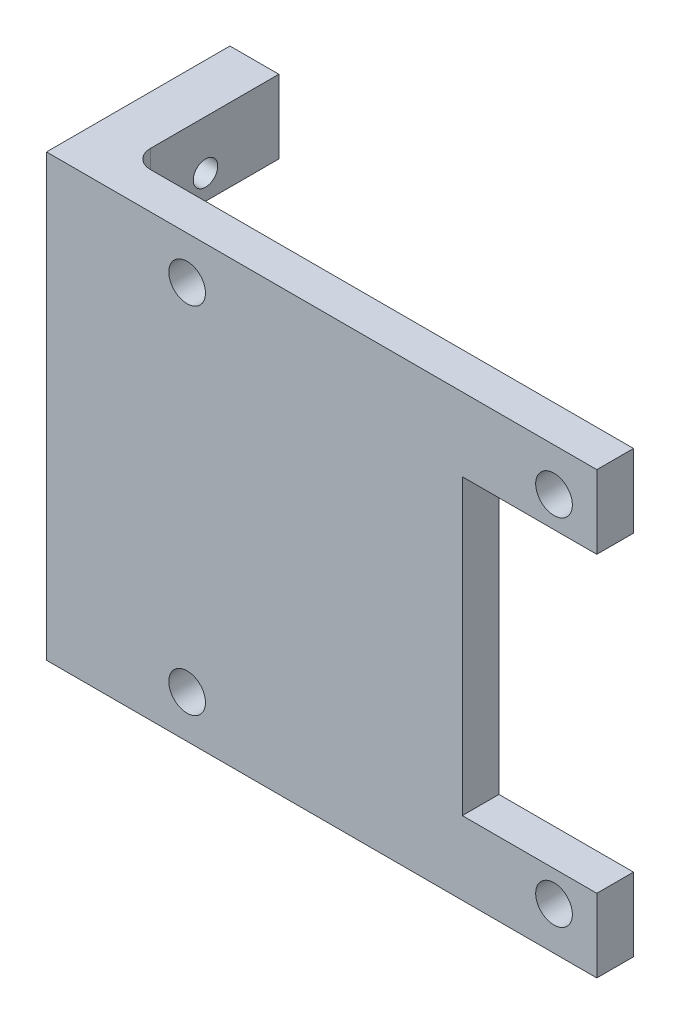
ISO-10303-21;
HEADER;
FILE_DESCRIPTION(('STEP AP214'),'2;1');
FILE_NAME('part.step','',(''),(''),'','','');
FILE_SCHEMA(('AUTOMOTIVE_DESIGN { 1 0 10303 214 1 1 1 1 }'));
ENDSEC;
DATA;
#1=APPLICATION_CONTEXT('core data for automotive mechanical design processes');
#2=APPLICATION_PROTOCOL_DEFINITION('international standard','automotive_design',2000,#1);
#3=PRODUCT_CONTEXT('',#1,'mechanical');
#4=PRODUCT('Part','Part','',(#3));
#5=PRODUCT_RELATED_PRODUCT_CATEGORY('part','',(#4));
#6=PRODUCT_DEFINITION_FORMATION('','',#4);
#7=PRODUCT_DEFINITION_CONTEXT('part definition',#1,'design');
#8=PRODUCT_DEFINITION('design','',#6,#7);
#9=PRODUCT_DEFINITION_SHAPE('','',#8);
#10=(LENGTH_UNIT() NAMED_UNIT(*) SI_UNIT(.MILLI.,.METRE.));
#11=(NAMED_UNIT(*) PLANE_ANGLE_UNIT() SI_UNIT($,.RADIAN.));
#12=(NAMED_UNIT(*) SI_UNIT($,.STERADIAN.) SOLID_ANGLE_UNIT());
#13=UNCERTAINTY_MEASURE_WITH_UNIT(LENGTH_MEASURE(1.E-05),#10,'distance_accuracy_value','');
#14=(GEOMETRIC_REPRESENTATION_CONTEXT(3) GLOBAL_UNCERTAINTY_ASSIGNED_CONTEXT((#13)) GLOBAL_UNIT_ASSIGNED_CONTEXT((#10,
#11,#12)) REPRESENTATION_CONTEXT('',''));
#15=CARTESIAN_POINT('',(0.,0.,0.));
#16=DIRECTION('',(0.,0.,1.));
#17=DIRECTION('',(1.,0.,0.));
#18=AXIS2_PLACEMENT_3D('',#15,#16,#17);
#19=CARTESIAN_POINT('',(18.5,-12.,3.));
#20=DIRECTION('',(-1.,0.,0.));
#21=DIRECTION('',(0.,-1.,0.));
#22=AXIS2_PLACEMENT_3D('',#19,#20,#21);
#23=PLANE('',#22);
#24=DIRECTION('',(0.,1.,0.));
#25=VECTOR('',#24,1.);
#26=CARTESIAN_POINT('',(18.5,-12.,0.));
#27=LINE('',#26,#25);
#28=CARTESIAN_POINT('',(18.5,-18.,0.));
#29=VERTEX_POINT('',#28);
#30=CARTESIAN_POINT('',(18.5,-12.,0.));
#31=VERTEX_POINT('',#30);
#32=EDGE_CURVE('E241',#29,#31,#27,.T.);
#33=ORIENTED_EDGE('',*,*,#32,.T.);
#34=DIRECTION('',(0.,0.,-1.));
#35=VECTOR('',#34,1.);
#36=CARTESIAN_POINT('',(18.5,-12.,3.));
#37=LINE('',#36,#35);
#38=CARTESIAN_POINT('',(18.5,-12.,3.));
#39=VERTEX_POINT('',#38);
#40=EDGE_CURVE('E287',#39,#31,#37,.T.);
#41=ORIENTED_EDGE('',*,*,#40,.F.);
#42=DIRECTION('',(0.,1.,0.));
#43=VECTOR('',#42,1.);
#44=CARTESIAN_POINT('',(18.5,-12.,3.));
#45=LINE('',#44,#43);
#46=CARTESIAN_POINT('',(18.5,-18.,3.));
#47=VERTEX_POINT('',#46);
#48=EDGE_CURVE('E242',#47,#39,#45,.T.);
#49=ORIENTED_EDGE('',*,*,#48,.F.);
#50=DIRECTION('',(0.,0.,-1.));
#51=VECTOR('',#50,1.);
#52=CARTESIAN_POINT('',(18.5,-18.,3.));
#53=LINE('',#52,#51);
#54=EDGE_CURVE('E258',#47,#29,#53,.T.);
#55=ORIENTED_EDGE('',*,*,#54,.T.);
#56=EDGE_LOOP('',(#33,#41,#49,#55));
#57=FACE_BOUND('',#56,.T.);
#58=ADVANCED_FACE('F34',(#57),#23,.F.);
#59=CARTESIAN_POINT('',(7.50000000000001,-12.,3.));
#60=DIRECTION('',(0.,-1.,0.));
#61=DIRECTION('',(1.,0.,0.));
#62=AXIS2_PLACEMENT_3D('',#59,#60,#61);
#63=PLANE('',#62);
#64=DIRECTION('',(-1.,0.,0.));
#65=VECTOR('',#64,1.);
#66=CARTESIAN_POINT('',(7.50000000000001,-12.,0.));
#67=LINE('',#66,#65);
#68=CARTESIAN_POINT('',(7.50000000000001,-12.,0.));
#69=VERTEX_POINT('',#68);
#70=EDGE_CURVE('E261',#31,#69,#67,.T.);
#71=ORIENTED_EDGE('',*,*,#70,.T.);
#72=DIRECTION('',(0.,0.,-1.));
#73=VECTOR('',#72,1.);
#74=CARTESIAN_POINT('',(7.50000000000001,-12.,3.));
#75=LINE('',#74,#73);
#76=CARTESIAN_POINT('',(7.50000000000001,-12.,3.));
#77=VERTEX_POINT('',#76);
#78=EDGE_CURVE('E284',#77,#69,#75,.T.);
#79=ORIENTED_EDGE('',*,*,#78,.F.);
#80=DIRECTION('',(-1.,0.,0.));
#81=VECTOR('',#80,1.);
#82=CARTESIAN_POINT('',(7.50000000000001,-12.,3.));
#83=LINE('',#82,#81);
#84=EDGE_CURVE('E245',#39,#77,#83,.T.);
#85=ORIENTED_EDGE('',*,*,#84,.F.);
#86=ORIENTED_EDGE('',*,*,#40,.T.);
#87=EDGE_LOOP('',(#71,#79,#85,#86));
#88=FACE_BOUND('',#87,.T.);
#89=ADVANCED_FACE('F377',(#88),#63,.F.);
#90=CARTESIAN_POINT('',(7.5,12.,3.));
#91=DIRECTION('',(-1.,0.,0.));
#92=DIRECTION('',(0.,-1.,0.));
#93=AXIS2_PLACEMENT_3D('',#90,#91,#92);
#94=PLANE('',#93);
#95=DIRECTION('',(0.,1.,0.));
#96=VECTOR('',#95,1.);
#97=CARTESIAN_POINT('',(7.5,12.,0.));
#98=LINE('',#97,#96);
#99=CARTESIAN_POINT('',(7.5,12.,0.));
#100=VERTEX_POINT('',#99);
#101=EDGE_CURVE('E263',#69,#100,#98,.T.);
#102=ORIENTED_EDGE('',*,*,#101,.T.);
#103=DIRECTION('',(0.,0.,-1.));
#104=VECTOR('',#103,1.);
#105=CARTESIAN_POINT('',(7.5,12.,3.));
#106=LINE('',#105,#104);
#107=CARTESIAN_POINT('',(7.5,12.,3.));
#108=VERTEX_POINT('',#107);
#109=EDGE_CURVE('E281',#108,#100,#106,.T.);
#110=ORIENTED_EDGE('',*,*,#109,.F.);
#111=DIRECTION('',(0.,1.,0.));
#112=VECTOR('',#111,1.);
#113=CARTESIAN_POINT('',(7.5,12.,3.));
#114=LINE('',#113,#112);
#115=EDGE_CURVE('E248',#77,#108,#114,.T.);
#116=ORIENTED_EDGE('',*,*,#115,.F.);
#117=ORIENTED_EDGE('',*,*,#78,.T.);
#118=EDGE_LOOP('',(#102,#110,#116,#117));
#119=FACE_BOUND('',#118,.T.);
#120=ADVANCED_FACE('F382',(#119),#94,.F.);
#121=CARTESIAN_POINT('',(18.5,12.,3.));
#122=DIRECTION('',(0.,1.,0.));
#123=DIRECTION('',(-1.,0.,0.));
#124=AXIS2_PLACEMENT_3D('',#121,#122,#123);
#125=PLANE('',#124);
#126=DIRECTION('',(1.,0.,0.));
#127=VECTOR('',#126,1.);
#128=CARTESIAN_POINT('',(18.5,12.,0.));
#129=LINE('',#128,#127);
#130=CARTESIAN_POINT('',(18.5,12.,0.));
#131=VERTEX_POINT('',#130);
#132=EDGE_CURVE('E265',#100,#131,#129,.T.);
#133=ORIENTED_EDGE('',*,*,#132,.T.);
#134=DIRECTION('',(0.,0.,-1.));
#135=VECTOR('',#134,1.);
#136=CARTESIAN_POINT('',(18.5,12.,3.));
#137=LINE('',#136,#135);
#138=CARTESIAN_POINT('',(18.5,12.,3.));
#139=VERTEX_POINT('',#138);
#140=EDGE_CURVE('E278',#139,#131,#137,.T.);
#141=ORIENTED_EDGE('',*,*,#140,.F.);
#142=DIRECTION('',(1.,0.,0.));
#143=VECTOR('',#142,1.);
#144=CARTESIAN_POINT('',(18.5,12.,3.));
#145=LINE('',#144,#143);
#146=EDGE_CURVE('E250',#108,#139,#145,.T.);
#147=ORIENTED_EDGE('',*,*,#146,.F.);
#148=ORIENTED_EDGE('',*,*,#109,.T.);
#149=EDGE_LOOP('',(#133,#141,#147,#148));
#150=FACE_BOUND('',#149,.T.);
#151=ADVANCED_FACE('F388',(#150),#125,.F.);
#152=CARTESIAN_POINT('',(18.5,18.,3.));
#153=DIRECTION('',(-1.,0.,0.));
#154=DIRECTION('',(0.,0.,1.));
#155=AXIS2_PLACEMENT_3D('',#152,#153,#154);
#156=PLANE('',#155);
#157=DIRECTION('',(0.,1.,0.));
#158=VECTOR('',#157,1.);
#159=CARTESIAN_POINT('',(18.5,18.,0.));
#160=LINE('',#159,#158);
#161=CARTESIAN_POINT('',(18.5,18.,0.));
#162=VERTEX_POINT('',#161);
#163=EDGE_CURVE('E267',#131,#162,#160,.T.);
#164=ORIENTED_EDGE('',*,*,#163,.T.);
#165=DIRECTION('',(0.,0.,-1.));
#166=VECTOR('',#165,1.);
#167=CARTESIAN_POINT('',(18.5,18.,3.));
#168=LINE('',#167,#166);
#169=CARTESIAN_POINT('',(18.5,18.,3.));
#170=VERTEX_POINT('',#169);
#171=EDGE_CURVE('E275',#170,#162,#168,.T.);
#172=ORIENTED_EDGE('',*,*,#171,.F.);
#173=DIRECTION('',(0.,1.,0.));
#174=VECTOR('',#173,1.);
#175=CARTESIAN_POINT('',(18.5,18.,3.));
#176=LINE('',#175,#174);
#177=EDGE_CURVE('E252',#139,#170,#176,.T.);
#178=ORIENTED_EDGE('',*,*,#177,.F.);
#179=ORIENTED_EDGE('',*,*,#140,.T.);
#180=EDGE_LOOP('',(#164,#172,#178,#179));
#181=FACE_BOUND('',#180,.T.);
#182=ADVANCED_FACE('F392',(#181),#156,.F.);
#183=CARTESIAN_POINT('',(-18.5,18.,3.));
#184=DIRECTION('',(0.,-1.,0.));
#185=DIRECTION('',(0.,0.,-1.));
#186=AXIS2_PLACEMENT_3D('',#183,#184,#185);
#187=PLANE('',#186);
#188=DIRECTION('',(-1.,0.,0.));
#189=VECTOR('',#188,1.);
#190=CARTESIAN_POINT('',(-18.5,18.,0.));
#191=LINE('',#190,#189);
#192=CARTESIAN_POINT('',(-21.,18.,0.));
#193=VERTEX_POINT('',#192);
#194=EDGE_CURVE('E269',#162,#193,#191,.T.);
#195=ORIENTED_EDGE('',*,*,#194,.T.);
#196=CARTESIAN_POINT('',(-21.,18.,-1.5));
#197=DIRECTION('',(0.,-1.,0.));
#198=DIRECTION('',(0.,0.,-1.));
#199=AXIS2_PLACEMENT_3D('',#196,#197,#198);
#200=CIRCLE('',#199,1.5);
#201=CARTESIAN_POINT('',(-22.5,18.,-1.5));
#202=VERTEX_POINT('',#201);
#203=EDGE_CURVE('E309',#193,#202,#200,.T.);
#204=ORIENTED_EDGE('',*,*,#203,.T.);
#205=DIRECTION('',(0.,0.,1.));
#206=VECTOR('',#205,1.);
#207=CARTESIAN_POINT('',(-22.5,18.,-12.));
#208=LINE('',#207,#206);
#209=CARTESIAN_POINT('',(-22.5,18.,-12.));
#210=VERTEX_POINT('',#209);
#211=EDGE_CURVE('E200',#210,#202,#208,.T.);
#212=ORIENTED_EDGE('',*,*,#211,.F.);
#213=DIRECTION('',(-1.,0.,0.));
#214=VECTOR('',#213,1.);
#215=CARTESIAN_POINT('',(-26.5,18.,-12.));
#216=LINE('',#215,#214);
#217=CARTESIAN_POINT('',(-26.5,18.,-12.));
#218=VERTEX_POINT('',#217);
#219=EDGE_CURVE('E185',#210,#218,#216,.T.);
#220=ORIENTED_EDGE('',*,*,#219,.T.);
#221=DIRECTION('',(0.,0.,-1.));
#222=VECTOR('',#221,1.);
#223=CARTESIAN_POINT('',(-26.5,18.,3.));
#224=LINE('',#223,#222);
#225=CARTESIAN_POINT('',(-26.5,18.,3.));
#226=VERTEX_POINT('',#225);
#227=EDGE_CURVE('E203',#226,#218,#224,.T.);
#228=ORIENTED_EDGE('',*,*,#227,.F.);
#229=DIRECTION('',(-1.,0.,0.));
#230=VECTOR('',#229,1.);
#231=CARTESIAN_POINT('',(-18.5,18.,3.));
#232=LINE('',#231,#230);
#233=EDGE_CURVE('E254',#170,#226,#232,.T.);
#234=ORIENTED_EDGE('',*,*,#233,.F.);
#235=ORIENTED_EDGE('',*,*,#171,.T.);
#236=EDGE_LOOP('',(#195,#204,#212,#220,#228,#234,#235));
#237=FACE_BOUND('',#236,.T.);
#238=ADVANCED_FACE('F346',(#237),#187,.F.);
#239=CARTESIAN_POINT('',(-18.5,-18.,3.));
#240=DIRECTION('',(0.,1.,0.));
#241=DIRECTION('',(0.,0.,1.));
#242=AXIS2_PLACEMENT_3D('',#239,#240,#241);
#243=PLANE('',#242);
#244=DIRECTION('',(0.,0.,1.));
#245=VECTOR('',#244,1.);
#246=CARTESIAN_POINT('',(-26.5,-18.,0.));
#247=LINE('',#246,#245);
#248=CARTESIAN_POINT('',(-26.5,-18.,-12.));
#249=VERTEX_POINT('',#248);
#250=CARTESIAN_POINT('',(-26.5,-18.,3.));
#251=VERTEX_POINT('',#250);
#252=EDGE_CURVE('E212',#249,#251,#247,.T.);
#253=ORIENTED_EDGE('',*,*,#252,.F.);
#254=DIRECTION('',(1.,0.,0.));
#255=VECTOR('',#254,1.);
#256=CARTESIAN_POINT('',(-26.5,-18.,-12.));
#257=LINE('',#256,#255);
#258=CARTESIAN_POINT('',(-22.5,-18.,-12.));
#259=VERTEX_POINT('',#258);
#260=EDGE_CURVE('E169',#249,#259,#257,.T.);
#261=ORIENTED_EDGE('',*,*,#260,.T.);
#262=DIRECTION('',(0.,0.,1.));
#263=VECTOR('',#262,1.);
#264=CARTESIAN_POINT('',(-22.5,-18.,-12.));
#265=LINE('',#264,#263);
#266=CARTESIAN_POINT('',(-22.5,-18.,-1.5));
#267=VERTEX_POINT('',#266);
#268=EDGE_CURVE('E158',#259,#267,#265,.T.);
#269=ORIENTED_EDGE('',*,*,#268,.T.);
#270=CARTESIAN_POINT('',(-21.,-18.,-1.5));
#271=DIRECTION('',(0.,1.,0.));
#272=DIRECTION('',(0.,0.,1.));
#273=AXIS2_PLACEMENT_3D('',#270,#271,#272);
#274=CIRCLE('',#273,1.5);
#275=CARTESIAN_POINT('',(-21.,-18.,0.));
#276=VERTEX_POINT('',#275);
#277=EDGE_CURVE('E43',#267,#276,#274,.T.);
#278=ORIENTED_EDGE('',*,*,#277,.T.);
#279=DIRECTION('',(1.,0.,0.));
#280=VECTOR('',#279,1.);
#281=CARTESIAN_POINT('',(-18.5,-18.,0.));
#282=LINE('',#281,#280);
#283=EDGE_CURVE('E246',#276,#29,#282,.T.);
#284=ORIENTED_EDGE('',*,*,#283,.T.);
#285=ORIENTED_EDGE('',*,*,#54,.F.);
#286=DIRECTION('',(1.,0.,0.));
#287=VECTOR('',#286,1.);
#288=CARTESIAN_POINT('',(-18.5,-18.,3.));
#289=LINE('',#288,#287);
#290=EDGE_CURVE('E256',#251,#47,#289,.T.);
#291=ORIENTED_EDGE('',*,*,#290,.F.);
#292=EDGE_LOOP('',(#253,#261,#269,#278,#284,#285,#291));
#293=FACE_BOUND('',#292,.T.);
#294=ADVANCED_FACE('F334',(#293),#243,.F.);
#295=CARTESIAN_POINT('',(0.,0.,3.));
#296=DIRECTION('',(0.,0.,1.));
#297=DIRECTION('',(1.,0.,0.));
#298=AXIS2_PLACEMENT_3D('',#295,#296,#297);
#299=PLANE('',#298);
#300=CARTESIAN_POINT('',(-15.,14.5,3.));
#301=DIRECTION('',(0.,0.,1.));
#302=DIRECTION('',(1.,0.,0.));
#303=AXIS2_PLACEMENT_3D('',#300,#301,#302);
#304=CIRCLE('',#303,1.5);
#305=CARTESIAN_POINT('',(-13.5,14.5,3.));
#306=VERTEX_POINT('',#305);
#307=EDGE_CURVE('E229',#306,#306,#304,.T.);
#308=ORIENTED_EDGE('',*,*,#307,.F.);
#309=EDGE_LOOP('',(#308));
#310=FACE_BOUND('',#309,.T.);
#311=CARTESIAN_POINT('',(15.,14.5,3.));
#312=DIRECTION('',(0.,0.,1.));
#313=DIRECTION('',(1.,0.,0.));
#314=AXIS2_PLACEMENT_3D('',#311,#312,#313);
#315=CIRCLE('',#314,1.5);
#316=CARTESIAN_POINT('',(16.5,14.5,3.));
#317=VERTEX_POINT('',#316);
#318=EDGE_CURVE('E222',#317,#317,#315,.T.);
#319=ORIENTED_EDGE('',*,*,#318,.F.);
#320=EDGE_LOOP('',(#319));
#321=FACE_BOUND('',#320,.T.);
#322=CARTESIAN_POINT('',(15.,-14.5,3.));
#323=DIRECTION('',(0.,0.,1.));
#324=DIRECTION('',(1.,0.,0.));
#325=AXIS2_PLACEMENT_3D('',#322,#323,#324);
#326=CIRCLE('',#325,1.5);
#327=CARTESIAN_POINT('',(16.5,-14.5,3.));
#328=VERTEX_POINT('',#327);
#329=EDGE_CURVE('E221',#328,#328,#326,.T.);
#330=ORIENTED_EDGE('',*,*,#329,.F.);
#331=EDGE_LOOP('',(#330));
#332=FACE_BOUND('',#331,.T.);
#333=CARTESIAN_POINT('',(-15.,-14.5,3.));
#334=DIRECTION('',(0.,0.,1.));
#335=DIRECTION('',(1.,0.,0.));
#336=AXIS2_PLACEMENT_3D('',#333,#334,#335);
#337=CIRCLE('',#336,1.5);
#338=CARTESIAN_POINT('',(-13.5,-14.5,3.));
#339=VERTEX_POINT('',#338);
#340=EDGE_CURVE('E238',#339,#339,#337,.T.);
#341=ORIENTED_EDGE('',*,*,#340,.F.);
#342=EDGE_LOOP('',(#341));
#343=FACE_BOUND('',#342,.T.);
#344=ORIENTED_EDGE('',*,*,#48,.T.);
#345=ORIENTED_EDGE('',*,*,#84,.T.);
#346=ORIENTED_EDGE('',*,*,#115,.T.);
#347=ORIENTED_EDGE('',*,*,#146,.T.);
#348=ORIENTED_EDGE('',*,*,#177,.T.);
#349=ORIENTED_EDGE('',*,*,#233,.T.);
#350=DIRECTION('',(0.,1.,0.));
#351=VECTOR('',#350,1.);
#352=CARTESIAN_POINT('',(-26.5,-18.,3.));
#353=LINE('',#352,#351);
#354=EDGE_CURVE('E214',#251,#226,#353,.T.);
#355=ORIENTED_EDGE('',*,*,#354,.F.);
#356=ORIENTED_EDGE('',*,*,#290,.T.);
#357=EDGE_LOOP('',(#344,#345,#346,#347,#348,#349,#355,#356));
#358=FACE_BOUND('',#357,.T.);
#359=ADVANCED_FACE('F339',(#310,#321,#332,#343,#358),#299,.T.);
#360=CARTESIAN_POINT('',(0.,0.,0.));
#361=DIRECTION('',(0.,0.,1.));
#362=DIRECTION('',(1.,0.,0.));
#363=AXIS2_PLACEMENT_3D('',#360,#361,#362);
#364=PLANE('',#363);
#365=CARTESIAN_POINT('',(-15.,14.5,0.));
#366=DIRECTION('',(0.,0.,1.));
#367=DIRECTION('',(-1.,0.,0.));
#368=AXIS2_PLACEMENT_3D('',#365,#366,#367);
#369=CIRCLE('',#368,1.5);
#370=CARTESIAN_POINT('',(-16.5,14.5,0.));
#371=VERTEX_POINT('',#370);
#372=EDGE_CURVE('E217',#371,#371,#369,.T.);
#373=ORIENTED_EDGE('',*,*,#372,.T.);
#374=EDGE_LOOP('',(#373));
#375=FACE_BOUND('',#374,.T.);
#376=CARTESIAN_POINT('',(15.,14.5,0.));
#377=DIRECTION('',(0.,0.,1.));
#378=DIRECTION('',(1.,0.,0.));
#379=AXIS2_PLACEMENT_3D('',#376,#377,#378);
#380=CIRCLE('',#379,1.5);
#381=CARTESIAN_POINT('',(16.5,14.5,0.));
#382=VERTEX_POINT('',#381);
#383=EDGE_CURVE('E226',#382,#382,#380,.T.);
#384=ORIENTED_EDGE('',*,*,#383,.T.);
#385=EDGE_LOOP('',(#384));
#386=FACE_BOUND('',#385,.T.);
#387=CARTESIAN_POINT('',(15.,-14.5,0.));
#388=DIRECTION('',(0.,0.,1.));
#389=DIRECTION('',(-1.,0.,0.));
#390=AXIS2_PLACEMENT_3D('',#387,#388,#389);
#391=CIRCLE('',#390,1.5);
#392=CARTESIAN_POINT('',(13.5,-14.5,0.));
#393=VERTEX_POINT('',#392);
#394=EDGE_CURVE('E218',#393,#393,#391,.T.);
#395=ORIENTED_EDGE('',*,*,#394,.T.);
#396=EDGE_LOOP('',(#395));
#397=FACE_BOUND('',#396,.T.);
#398=CARTESIAN_POINT('',(-15.,-14.5,0.));
#399=DIRECTION('',(0.,0.,1.));
#400=DIRECTION('',(1.,0.,0.));
#401=AXIS2_PLACEMENT_3D('',#398,#399,#400);
#402=CIRCLE('',#401,1.5);
#403=CARTESIAN_POINT('',(-13.5,-14.5,0.));
#404=VERTEX_POINT('',#403);
#405=EDGE_CURVE('E225',#404,#404,#402,.T.);
#406=ORIENTED_EDGE('',*,*,#405,.T.);
#407=EDGE_LOOP('',(#406));
#408=FACE_BOUND('',#407,.T.);
#409=DIRECTION('',(0.,-1.,0.));
#410=VECTOR('',#409,1.);
#411=CARTESIAN_POINT('',(-26.5,18.,0.));
#412=LINE('',#411,#410);
#413=CARTESIAN_POINT('',(-26.5,10.5,0.));
#414=VERTEX_POINT('',#413);
#415=CARTESIAN_POINT('',(-26.5,-10.5,0.));
#416=VERTEX_POINT('',#415);
#417=EDGE_CURVE('E210',#414,#416,#412,.T.);
#418=ORIENTED_EDGE('',*,*,#417,.F.);
#419=DIRECTION('',(1.,0.,0.));
#420=VECTOR('',#419,1.);
#421=CARTESIAN_POINT('',(0.,10.5,0.));
#422=LINE('',#421,#420);
#423=CARTESIAN_POINT('',(-21.,10.5,0.));
#424=VERTEX_POINT('',#423);
#425=EDGE_CURVE('E297',#414,#424,#422,.T.);
#426=ORIENTED_EDGE('',*,*,#425,.T.);
#427=DIRECTION('',(0.,1.,0.));
#428=VECTOR('',#427,1.);
#429=CARTESIAN_POINT('',(-21.,0.,0.));
#430=LINE('',#429,#428);
#431=EDGE_CURVE('E295',#424,#193,#430,.T.);
#432=ORIENTED_EDGE('',*,*,#431,.T.);
#433=ORIENTED_EDGE('',*,*,#194,.F.);
#434=ORIENTED_EDGE('',*,*,#163,.F.);
#435=ORIENTED_EDGE('',*,*,#132,.F.);
#436=ORIENTED_EDGE('',*,*,#101,.F.);
#437=ORIENTED_EDGE('',*,*,#70,.F.);
#438=ORIENTED_EDGE('',*,*,#32,.F.);
#439=ORIENTED_EDGE('',*,*,#283,.F.);
#440=DIRECTION('',(0.,1.,0.));
#441=VECTOR('',#440,1.);
#442=CARTESIAN_POINT('',(-21.,0.,0.));
#443=LINE('',#442,#441);
#444=CARTESIAN_POINT('',(-21.,-10.5,0.));
#445=VERTEX_POINT('',#444);
#446=EDGE_CURVE('E292',#276,#445,#443,.T.);
#447=ORIENTED_EDGE('',*,*,#446,.T.);
#448=DIRECTION('',(-1.,0.,0.));
#449=VECTOR('',#448,1.);
#450=CARTESIAN_POINT('',(0.,-10.5,0.));
#451=LINE('',#450,#449);
#452=EDGE_CURVE('E290',#445,#416,#451,.T.);
#453=ORIENTED_EDGE('',*,*,#452,.T.);
#454=EDGE_LOOP('',(#418,#426,#432,#433,#434,#435,#436,#437,#438,#439,#447,#453));
#455=FACE_BOUND('',#454,.T.);
#456=ADVANCED_FACE('F330',(#375,#386,#397,#408,#455),#364,.F.);
#457=CARTESIAN_POINT('',(-15.,-14.5,3.001));
#458=DIRECTION('',(0.,0.,-1.));
#459=DIRECTION('',(-1.,0.,0.));
#460=AXIS2_PLACEMENT_3D('',#457,#458,#459);
#461=CYLINDRICAL_SURFACE('',#460,1.5);
#462=ORIENTED_EDGE('',*,*,#340,.T.);
#463=EDGE_LOOP('',(#462));
#464=FACE_BOUND('',#463,.T.);
#465=ORIENTED_EDGE('',*,*,#405,.F.);
#466=EDGE_LOOP('',(#465));
#467=FACE_BOUND('',#466,.T.);
#468=ADVANCED_FACE('F403',(#464,#467),#461,.F.);
#469=CARTESIAN_POINT('',(15.,-14.5,3.001));
#470=DIRECTION('',(0.,0.,-1.));
#471=DIRECTION('',(-1.,0.,0.));
#472=AXIS2_PLACEMENT_3D('',#469,#470,#471);
#473=CYLINDRICAL_SURFACE('',#472,1.5);
#474=ORIENTED_EDGE('',*,*,#329,.T.);
#475=EDGE_LOOP('',(#474));
#476=FACE_BOUND('',#475,.T.);
#477=ORIENTED_EDGE('',*,*,#394,.F.);
#478=EDGE_LOOP('',(#477));
#479=FACE_BOUND('',#478,.T.);
#480=ADVANCED_FACE('F410',(#476,#479),#473,.F.);
#481=CARTESIAN_POINT('',(15.,14.5,3.001));
#482=DIRECTION('',(0.,0.,-1.));
#483=DIRECTION('',(-1.,0.,0.));
#484=AXIS2_PLACEMENT_3D('',#481,#482,#483);
#485=CYLINDRICAL_SURFACE('',#484,1.5);
#486=ORIENTED_EDGE('',*,*,#318,.T.);
#487=EDGE_LOOP('',(#486));
#488=FACE_BOUND('',#487,.T.);
#489=ORIENTED_EDGE('',*,*,#383,.F.);
#490=EDGE_LOOP('',(#489));
#491=FACE_BOUND('',#490,.T.);
#492=ADVANCED_FACE('F415',(#488,#491),#485,.F.);
#493=CARTESIAN_POINT('',(-15.,14.5,3.001));
#494=DIRECTION('',(0.,0.,-1.));
#495=DIRECTION('',(-1.,0.,0.));
#496=AXIS2_PLACEMENT_3D('',#493,#494,#495);
#497=CYLINDRICAL_SURFACE('',#496,1.5);
#498=ORIENTED_EDGE('',*,*,#307,.T.);
#499=EDGE_LOOP('',(#498));
#500=FACE_BOUND('',#499,.T.);
#501=ORIENTED_EDGE('',*,*,#372,.F.);
#502=EDGE_LOOP('',(#501));
#503=FACE_BOUND('',#502,.T.);
#504=ADVANCED_FACE('F412',(#500,#503),#497,.F.);
#505=CARTESIAN_POINT('',(-26.5,0.,0.));
#506=DIRECTION('',(-1.,0.,0.));
#507=DIRECTION('',(0.,-1.,0.));
#508=AXIS2_PLACEMENT_3D('',#505,#506,#507);
#509=PLANE('',#508);
#510=CARTESIAN_POINT('',(-26.5,14.,-6.));
#511=DIRECTION('',(-1.,0.,0.));
#512=DIRECTION('',(0.,-1.,0.));
#513=AXIS2_PLACEMENT_3D('',#510,#511,#512);
#514=CIRCLE('',#513,1.);
#515=CARTESIAN_POINT('',(-26.5,13.,-6.));
#516=VERTEX_POINT('',#515);
#517=EDGE_CURVE('E176',#516,#516,#514,.F.);
#518=ORIENTED_EDGE('',*,*,#517,.T.);
#519=EDGE_LOOP('',(#518));
#520=FACE_BOUND('',#519,.T.);
#521=CARTESIAN_POINT('',(-26.5,-14.,-6.));
#522=DIRECTION('',(-1.,0.,0.));
#523=DIRECTION('',(0.,-1.,0.));
#524=AXIS2_PLACEMENT_3D('',#521,#522,#523);
#525=CIRCLE('',#524,1.);
#526=CARTESIAN_POINT('',(-26.5,-15.,-6.));
#527=VERTEX_POINT('',#526);
#528=EDGE_CURVE('E179',#527,#527,#525,.F.);
#529=ORIENTED_EDGE('',*,*,#528,.T.);
#530=EDGE_LOOP('',(#529));
#531=FACE_BOUND('',#530,.T.);
#532=ORIENTED_EDGE('',*,*,#227,.T.);
#533=DIRECTION('',(0.,-1.,0.));
#534=VECTOR('',#533,1.);
#535=CARTESIAN_POINT('',(-26.5,12.,-12.));
#536=LINE('',#535,#534);
#537=CARTESIAN_POINT('',(-26.5,12.,-12.));
#538=VERTEX_POINT('',#537);
#539=EDGE_CURVE('E190',#218,#538,#536,.T.);
#540=ORIENTED_EDGE('',*,*,#539,.T.);
#541=DIRECTION('',(0.,0.,1.));
#542=VECTOR('',#541,1.);
#543=CARTESIAN_POINT('',(-26.5,12.,-12.));
#544=LINE('',#543,#542);
#545=CARTESIAN_POINT('',(-26.5,12.,-1.5));
#546=VERTEX_POINT('',#545);
#547=EDGE_CURVE('E199',#538,#546,#544,.T.);
#548=ORIENTED_EDGE('',*,*,#547,.T.);
#549=CARTESIAN_POINT('',(-26.5,10.5,-1.5));
#550=DIRECTION('',(-1.,0.,0.));
#551=DIRECTION('',(0.,-1.,0.));
#552=AXIS2_PLACEMENT_3D('',#549,#550,#551);
#553=CIRCLE('',#552,1.5);
#554=EDGE_CURVE('E307',#546,#414,#553,.F.);
#555=ORIENTED_EDGE('',*,*,#554,.T.);
#556=ORIENTED_EDGE('',*,*,#417,.T.);
#557=CARTESIAN_POINT('',(-26.5,-10.5,-1.5));
#558=DIRECTION('',(-1.,0.,0.));
#559=DIRECTION('',(0.,-1.,0.));
#560=AXIS2_PLACEMENT_3D('',#557,#558,#559);
#561=CIRCLE('',#560,1.5);
#562=CARTESIAN_POINT('',(-26.5,-12.,-1.5));
#563=VERTEX_POINT('',#562);
#564=EDGE_CURVE('E11',#416,#563,#561,.F.);
#565=ORIENTED_EDGE('',*,*,#564,.T.);
#566=DIRECTION('',(0.,0.,1.));
#567=VECTOR('',#566,1.);
#568=CARTESIAN_POINT('',(-26.5,-12.,-12.));
#569=LINE('',#568,#567);
#570=CARTESIAN_POINT('',(-26.5,-12.,-12.));
#571=VERTEX_POINT('',#570);
#572=EDGE_CURVE('E152',#571,#563,#569,.T.);
#573=ORIENTED_EDGE('',*,*,#572,.F.);
#574=DIRECTION('',(0.,-1.,0.));
#575=VECTOR('',#574,1.);
#576=CARTESIAN_POINT('',(-26.5,-12.,-12.));
#577=LINE('',#576,#575);
#578=EDGE_CURVE('E156',#571,#249,#577,.T.);
#579=ORIENTED_EDGE('',*,*,#578,.T.);
#580=ORIENTED_EDGE('',*,*,#252,.T.);
#581=ORIENTED_EDGE('',*,*,#354,.T.);
#582=EDGE_LOOP('',(#532,#540,#548,#555,#556,#565,#573,#579,#580,#581));
#583=FACE_BOUND('',#582,.T.);
#584=ADVANCED_FACE('F154',(#520,#531,#583),#509,.T.);
#585=CARTESIAN_POINT('',(-22.5,18.,-12.));
#586=DIRECTION('',(1.,0.,0.));
#587=DIRECTION('',(0.,0.,-1.));
#588=AXIS2_PLACEMENT_3D('',#585,#586,#587);
#589=PLANE('',#588);
#590=CARTESIAN_POINT('',(-22.5,14.,-6.));
#591=DIRECTION('',(1.,0.,0.));
#592=DIRECTION('',(0.,0.,-1.));
#593=AXIS2_PLACEMENT_3D('',#590,#591,#592);
#594=CIRCLE('',#593,1.);
#595=CARTESIAN_POINT('',(-22.5,14.,-7.));
#596=VERTEX_POINT('',#595);
#597=EDGE_CURVE('E173',#596,#596,#594,.T.);
#598=ORIENTED_EDGE('',*,*,#597,.F.);
#599=EDGE_LOOP('',(#598));
#600=FACE_BOUND('',#599,.T.);
#601=ORIENTED_EDGE('',*,*,#211,.T.);
#602=DIRECTION('',(0.,1.,0.));
#603=VECTOR('',#602,1.);
#604=CARTESIAN_POINT('',(-22.5,18.,-1.5));
#605=LINE('',#604,#603);
#606=CARTESIAN_POINT('',(-22.5,12.,-1.5));
#607=VERTEX_POINT('',#606);
#608=EDGE_CURVE('E302',#202,#607,#605,.F.);
#609=ORIENTED_EDGE('',*,*,#608,.T.);
#610=DIRECTION('',(0.,0.,1.));
#611=VECTOR('',#610,1.);
#612=CARTESIAN_POINT('',(-22.5,12.,-12.));
#613=LINE('',#612,#611);
#614=CARTESIAN_POINT('',(-22.5,12.,-12.));
#615=VERTEX_POINT('',#614);
#616=EDGE_CURVE('E204',#615,#607,#613,.T.);
#617=ORIENTED_EDGE('',*,*,#616,.F.);
#618=DIRECTION('',(0.,1.,0.));
#619=VECTOR('',#618,1.);
#620=CARTESIAN_POINT('',(-22.5,18.,-12.));
#621=LINE('',#620,#619);
#622=EDGE_CURVE('E196',#615,#210,#621,.T.);
#623=ORIENTED_EDGE('',*,*,#622,.T.);
#624=EDGE_LOOP('',(#601,#609,#617,#623));
#625=FACE_BOUND('',#624,.T.);
#626=ADVANCED_FACE('F353',(#600,#625),#589,.T.);
#627=CARTESIAN_POINT('',(-22.5,12.,-12.));
#628=DIRECTION('',(0.,-1.,0.));
#629=DIRECTION('',(0.,0.,-1.));
#630=AXIS2_PLACEMENT_3D('',#627,#628,#629);
#631=PLANE('',#630);
#632=ORIENTED_EDGE('',*,*,#616,.T.);
#633=DIRECTION('',(1.,0.,0.));
#634=VECTOR('',#633,1.);
#635=CARTESIAN_POINT('',(-22.5,12.,-1.5));
#636=LINE('',#635,#634);
#637=EDGE_CURVE('E300',#607,#546,#636,.F.);
#638=ORIENTED_EDGE('',*,*,#637,.T.);
#639=ORIENTED_EDGE('',*,*,#547,.F.);
#640=DIRECTION('',(1.,0.,0.));
#641=VECTOR('',#640,1.);
#642=CARTESIAN_POINT('',(-22.5,12.,-12.));
#643=LINE('',#642,#641);
#644=EDGE_CURVE('E193',#538,#615,#643,.T.);
#645=ORIENTED_EDGE('',*,*,#644,.T.);
#646=EDGE_LOOP('',(#632,#638,#639,#645));
#647=FACE_BOUND('',#646,.T.);
#648=ADVANCED_FACE('F356',(#647),#631,.T.);
#649=CARTESIAN_POINT('',(0.,0.,-12.));
#650=DIRECTION('',(0.,0.,-1.));
#651=DIRECTION('',(-1.,0.,0.));
#652=AXIS2_PLACEMENT_3D('',#649,#650,#651);
#653=PLANE('',#652);
#654=ORIENTED_EDGE('',*,*,#219,.F.);
#655=ORIENTED_EDGE('',*,*,#622,.F.);
#656=ORIENTED_EDGE('',*,*,#644,.F.);
#657=ORIENTED_EDGE('',*,*,#539,.F.);
#658=EDGE_LOOP('',(#654,#655,#656,#657));
#659=FACE_BOUND('',#658,.T.);
#660=ADVANCED_FACE('F350',(#659),#653,.T.);
#661=CARTESIAN_POINT('',(-22.5,-12.,-12.));
#662=DIRECTION('',(0.,1.,0.));
#663=DIRECTION('',(0.,0.,1.));
#664=AXIS2_PLACEMENT_3D('',#661,#662,#663);
#665=PLANE('',#664);
#666=ORIENTED_EDGE('',*,*,#572,.T.);
#667=DIRECTION('',(-1.,0.,0.));
#668=VECTOR('',#667,1.);
#669=CARTESIAN_POINT('',(-22.5,-12.,-1.5));
#670=LINE('',#669,#668);
#671=CARTESIAN_POINT('',(-22.5,-12.,-1.5));
#672=VERTEX_POINT('',#671);
#673=EDGE_CURVE('E56',#563,#672,#670,.F.);
#674=ORIENTED_EDGE('',*,*,#673,.T.);
#675=DIRECTION('',(0.,0.,1.));
#676=VECTOR('',#675,1.);
#677=CARTESIAN_POINT('',(-22.5,-12.,-12.));
#678=LINE('',#677,#676);
#679=CARTESIAN_POINT('',(-22.5,-12.,-12.));
#680=VERTEX_POINT('',#679);
#681=EDGE_CURVE('E172',#680,#672,#678,.T.);
#682=ORIENTED_EDGE('',*,*,#681,.F.);
#683=DIRECTION('',(-1.,0.,0.));
#684=VECTOR('',#683,1.);
#685=CARTESIAN_POINT('',(-22.5,-12.,-12.));
#686=LINE('',#685,#684);
#687=EDGE_CURVE('E166',#680,#571,#686,.T.);
#688=ORIENTED_EDGE('',*,*,#687,.T.);
#689=EDGE_LOOP('',(#666,#674,#682,#688));
#690=FACE_BOUND('',#689,.T.);
#691=ADVANCED_FACE('F171',(#690),#665,.T.);
#692=CARTESIAN_POINT('',(-22.5,-18.,-12.));
#693=DIRECTION('',(1.,0.,0.));
#694=DIRECTION('',(0.,0.,-1.));
#695=AXIS2_PLACEMENT_3D('',#692,#693,#694);
#696=PLANE('',#695);
#697=CARTESIAN_POINT('',(-22.5,-14.,-6.));
#698=DIRECTION('',(1.,0.,0.));
#699=DIRECTION('',(0.,0.,1.));
#700=AXIS2_PLACEMENT_3D('',#697,#698,#699);
#701=CIRCLE('',#700,1.);
#702=CARTESIAN_POINT('',(-22.5,-14.,-5.));
#703=VERTEX_POINT('',#702);
#704=EDGE_CURVE('E318',#703,#703,#701,.T.);
#705=ORIENTED_EDGE('',*,*,#704,.F.);
#706=EDGE_LOOP('',(#705));
#707=FACE_BOUND('',#706,.T.);
#708=ORIENTED_EDGE('',*,*,#681,.T.);
#709=DIRECTION('',(0.,1.,0.));
#710=VECTOR('',#709,1.);
#711=CARTESIAN_POINT('',(-22.5,-18.,-1.5));
#712=LINE('',#711,#710);
#713=EDGE_CURVE('E304',#672,#267,#712,.F.);
#714=ORIENTED_EDGE('',*,*,#713,.T.);
#715=ORIENTED_EDGE('',*,*,#268,.F.);
#716=DIRECTION('',(0.,1.,0.));
#717=VECTOR('',#716,1.);
#718=CARTESIAN_POINT('',(-22.5,-18.,-12.));
#719=LINE('',#718,#717);
#720=EDGE_CURVE('E159',#259,#680,#719,.T.);
#721=ORIENTED_EDGE('',*,*,#720,.T.);
#722=EDGE_LOOP('',(#708,#714,#715,#721));
#723=FACE_BOUND('',#722,.T.);
#724=ADVANCED_FACE('F435',(#707,#723),#696,.T.);
#725=CARTESIAN_POINT('',(0.,0.,-12.));
#726=DIRECTION('',(0.,0.,1.));
#727=DIRECTION('',(1.,0.,0.));
#728=AXIS2_PLACEMENT_3D('',#725,#726,#727);
#729=PLANE('',#728);
#730=ORIENTED_EDGE('',*,*,#687,.F.);
#731=ORIENTED_EDGE('',*,*,#720,.F.);
#732=ORIENTED_EDGE('',*,*,#260,.F.);
#733=ORIENTED_EDGE('',*,*,#578,.F.);
#734=EDGE_LOOP('',(#730,#731,#732,#733));
#735=FACE_BOUND('',#734,.T.);
#736=ADVANCED_FACE('F164',(#735),#729,.F.);
#737=CARTESIAN_POINT('',(-26.501,-14.,-6.));
#738=DIRECTION('',(1.,0.,0.));
#739=DIRECTION('',(0.,0.,-1.));
#740=AXIS2_PLACEMENT_3D('',#737,#738,#739);
#741=CYLINDRICAL_SURFACE('',#740,1.);
#742=ORIENTED_EDGE('',*,*,#528,.F.);
#743=EDGE_LOOP('',(#742));
#744=FACE_BOUND('',#743,.T.);
#745=ORIENTED_EDGE('',*,*,#704,.T.);
#746=EDGE_LOOP('',(#745));
#747=FACE_BOUND('',#746,.T.);
#748=ADVANCED_FACE('F373',(#744,#747),#741,.F.);
#749=CARTESIAN_POINT('',(-26.501,14.,-6.));
#750=DIRECTION('',(1.,0.,0.));
#751=DIRECTION('',(0.,0.,-1.));
#752=AXIS2_PLACEMENT_3D('',#749,#750,#751);
#753=CYLINDRICAL_SURFACE('',#752,1.);
#754=ORIENTED_EDGE('',*,*,#517,.F.);
#755=EDGE_LOOP('',(#754));
#756=FACE_BOUND('',#755,.T.);
#757=ORIENTED_EDGE('',*,*,#597,.T.);
#758=EDGE_LOOP('',(#757));
#759=FACE_BOUND('',#758,.T.);
#760=ADVANCED_FACE('F366',(#756,#759),#753,.F.);
#761=CARTESIAN_POINT('',(-21.,0.,-1.5));
#762=DIRECTION('',(0.,1.,0.));
#763=DIRECTION('',(0.,0.,1.));
#764=AXIS2_PLACEMENT_3D('',#761,#762,#763);
#765=CYLINDRICAL_SURFACE('',#764,1.5);
#766=ORIENTED_EDGE('',*,*,#203,.F.);
#767=ORIENTED_EDGE('',*,*,#431,.F.);
#768=CARTESIAN_POINT('',(-21.,10.5,-1.5));
#769=DIRECTION('',(0.707106781186547,0.707106781186547,0.));
#770=DIRECTION('',(-0.707106781186547,0.707106781186547,0.));
#771=AXIS2_PLACEMENT_3D('',#768,#769,#770);
#772=ELLIPSE('',#771,2.12132034355964,1.5);
#773=EDGE_CURVE('E311',#607,#424,#772,.T.);
#774=ORIENTED_EDGE('',*,*,#773,.F.);
#775=ORIENTED_EDGE('',*,*,#608,.F.);
#776=EDGE_LOOP('',(#766,#767,#774,#775));
#777=FACE_BOUND('',#776,.T.);
#778=ADVANCED_FACE('F364',(#777),#765,.F.);
#779=CARTESIAN_POINT('',(0.,10.5,-1.5));
#780=DIRECTION('',(1.,0.,0.));
#781=DIRECTION('',(0.,0.,-1.));
#782=AXIS2_PLACEMENT_3D('',#779,#780,#781);
#783=CYLINDRICAL_SURFACE('',#782,1.5);
#784=ORIENTED_EDGE('',*,*,#554,.F.);
#785=ORIENTED_EDGE('',*,*,#637,.F.);
#786=ORIENTED_EDGE('',*,*,#773,.T.);
#787=ORIENTED_EDGE('',*,*,#425,.F.);
#788=EDGE_LOOP('',(#784,#785,#786,#787));
#789=FACE_BOUND('',#788,.T.);
#790=ADVANCED_FACE('F358',(#789),#783,.F.);
#791=CARTESIAN_POINT('',(0.,-10.5,-1.5));
#792=DIRECTION('',(-1.,0.,0.));
#793=DIRECTION('',(0.,0.,1.));
#794=AXIS2_PLACEMENT_3D('',#791,#792,#793);
#795=CYLINDRICAL_SURFACE('',#794,1.5);
#796=ORIENTED_EDGE('',*,*,#564,.F.);
#797=ORIENTED_EDGE('',*,*,#452,.F.);
#798=CARTESIAN_POINT('',(-21.,-10.5,-1.5));
#799=DIRECTION('',(-0.707106781186547,0.707106781186547,0.));
#800=DIRECTION('',(-0.707106781186547,-0.707106781186547,0.));
#801=AXIS2_PLACEMENT_3D('',#798,#799,#800);
#802=ELLIPSE('',#801,2.12132034355964,1.5);
#803=EDGE_CURVE('E38',#672,#445,#802,.T.);
#804=ORIENTED_EDGE('',*,*,#803,.F.);
#805=ORIENTED_EDGE('',*,*,#673,.F.);
#806=EDGE_LOOP('',(#796,#797,#804,#805));
#807=FACE_BOUND('',#806,.T.);
#808=ADVANCED_FACE('F36',(#807),#795,.F.);
#809=CARTESIAN_POINT('',(-21.,0.,-1.5));
#810=DIRECTION('',(0.,1.,0.));
#811=DIRECTION('',(0.,0.,1.));
#812=AXIS2_PLACEMENT_3D('',#809,#810,#811);
#813=CYLINDRICAL_SURFACE('',#812,1.5);
#814=ORIENTED_EDGE('',*,*,#277,.F.);
#815=ORIENTED_EDGE('',*,*,#713,.F.);
#816=ORIENTED_EDGE('',*,*,#803,.T.);
#817=ORIENTED_EDGE('',*,*,#446,.F.);
#818=EDGE_LOOP('',(#814,#815,#816,#817));
#819=FACE_BOUND('',#818,.T.);
#820=ADVANCED_FACE('F325',(#819),#813,.F.);
#821=CLOSED_SHELL('',(#58,#89,#120,#151,#182,#238,#294,#359,#456,#468,#480,#492,#504,#584,#626,
#648,#660,#691,#724,#736,#748,#760,#778,#790,#808,#820));
#822=MANIFOLD_SOLID_BREP('B2',#821);
#823=ADVANCED_BREP_SHAPE_REPRESENTATION('',(#18,#822),#14);
#824=SHAPE_DEFINITION_REPRESENTATION(#9,#823);
ENDSEC;
END-ISO-10303-21;
